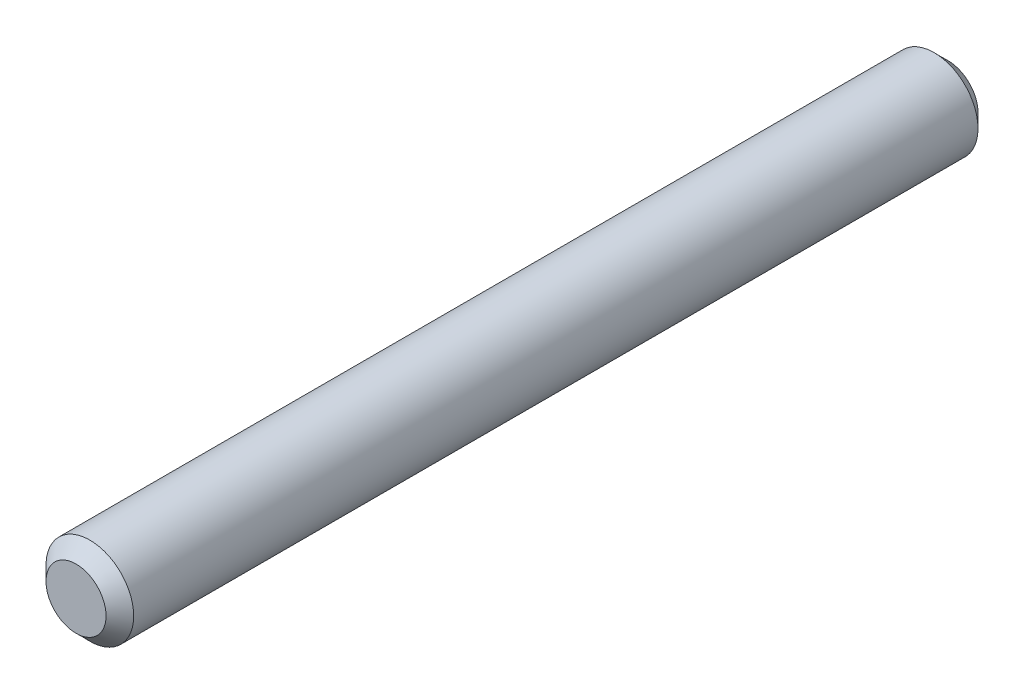
ISO-10303-21;
HEADER;
FILE_DESCRIPTION(('STEP AP214'),'2;1');
FILE_NAME('part.step','',(''),(''),'','','');
FILE_SCHEMA(('AUTOMOTIVE_DESIGN { 1 0 10303 214 1 1 1 1 }'));
ENDSEC;
DATA;
#1=APPLICATION_CONTEXT('core data for automotive mechanical design processes');
#2=APPLICATION_PROTOCOL_DEFINITION('international standard','automotive_design',2000,#1);
#3=PRODUCT_CONTEXT('',#1,'mechanical');
#4=PRODUCT('Part','Part','',(#3));
#5=PRODUCT_RELATED_PRODUCT_CATEGORY('part','',(#4));
#6=PRODUCT_DEFINITION_FORMATION('','',#4);
#7=PRODUCT_DEFINITION_CONTEXT('part definition',#1,'design');
#8=PRODUCT_DEFINITION('design','',#6,#7);
#9=PRODUCT_DEFINITION_SHAPE('','',#8);
#10=(LENGTH_UNIT() NAMED_UNIT(*) SI_UNIT(.MILLI.,.METRE.));
#11=(NAMED_UNIT(*) PLANE_ANGLE_UNIT() SI_UNIT($,.RADIAN.));
#12=(NAMED_UNIT(*) SI_UNIT($,.STERADIAN.) SOLID_ANGLE_UNIT());
#13=UNCERTAINTY_MEASURE_WITH_UNIT(LENGTH_MEASURE(1.E-05),#10,'distance_accuracy_value','');
#14=(GEOMETRIC_REPRESENTATION_CONTEXT(3) GLOBAL_UNCERTAINTY_ASSIGNED_CONTEXT((#13)) GLOBAL_UNIT_ASSIGNED_CONTEXT((#10,
#11,#12)) REPRESENTATION_CONTEXT('',''));
#15=CARTESIAN_POINT('',(0.,0.,0.));
#16=DIRECTION('',(0.,0.,1.));
#17=DIRECTION('',(1.,0.,0.));
#18=AXIS2_PLACEMENT_3D('',#15,#16,#17);
#19=CARTESIAN_POINT('',(0.,0.,-63.1419999539997));
#20=DIRECTION('',(0.,0.,0.999999999999998));
#21=DIRECTION('',(1.,0.,0.));
#22=AXIS2_PLACEMENT_3D('',#19,#20,#21);
#23=CYLINDRICAL_SURFACE('',#22,3.175);
#24=CARTESIAN_POINT('',(0.,0.,-62.1419999539998));
#25=DIRECTION('',(0.,0.,0.999999999999998));
#26=DIRECTION('',(1.,0.,0.));
#27=AXIS2_PLACEMENT_3D('',#24,#25,#26);
#28=CIRCLE('',#27,3.175);
#29=CARTESIAN_POINT('',(3.175,0.,-62.1419999539998));
#30=VERTEX_POINT('',#29);
#31=EDGE_CURVE('E59',#30,#30,#28,.T.);
#32=ORIENTED_EDGE('',*,*,#31,.T.);
#33=EDGE_LOOP('',(#32));
#34=FACE_BOUND('',#33,.T.);
#35=CARTESIAN_POINT('',(0.,0.,-1.));
#36=DIRECTION('',(0.,0.,0.999999999999998));
#37=DIRECTION('',(1.,0.,0.));
#38=AXIS2_PLACEMENT_3D('',#35,#36,#37);
#39=CIRCLE('',#38,3.175);
#40=CARTESIAN_POINT('',(3.175,0.,-1.));
#41=VERTEX_POINT('',#40);
#42=EDGE_CURVE('E63',#41,#41,#39,.F.);
#43=ORIENTED_EDGE('',*,*,#42,.T.);
#44=EDGE_LOOP('',(#43));
#45=FACE_BOUND('',#44,.T.);
#46=ADVANCED_FACE('F48',(#34,#45),#23,.T.);
#47=CARTESIAN_POINT('',(0.,0.,-63.1419999539997));
#48=DIRECTION('',(0.,0.,0.999999999999998));
#49=DIRECTION('',(1.,0.,0.));
#50=AXIS2_PLACEMENT_3D('',#47,#48,#49);
#51=PLANE('',#50);
#52=CARTESIAN_POINT('',(0.,0.,-63.1419999539997));
#53=DIRECTION('',(0.,0.,0.999999999999998));
#54=DIRECTION('',(1.,0.,0.));
#55=AXIS2_PLACEMENT_3D('',#52,#53,#54);
#56=CIRCLE('',#55,2.175);
#57=CARTESIAN_POINT('',(2.175,0.,-63.1419999539997));
#58=VERTEX_POINT('',#57);
#59=EDGE_CURVE('E55',#58,#58,#56,.F.);
#60=ORIENTED_EDGE('',*,*,#59,.T.);
#61=EDGE_LOOP('',(#60));
#62=FACE_BOUND('',#61,.T.);
#63=ADVANCED_FACE('F79',(#62),#51,.F.);
#64=CARTESIAN_POINT('',(0.,0.,0.));
#65=DIRECTION('',(0.,0.,0.999999999999998));
#66=DIRECTION('',(1.,0.,0.));
#67=AXIS2_PLACEMENT_3D('',#64,#65,#66);
#68=PLANE('',#67);
#69=CARTESIAN_POINT('',(0.,0.,0.));
#70=DIRECTION('',(0.,0.,0.999999999999998));
#71=DIRECTION('',(1.,0.,0.));
#72=AXIS2_PLACEMENT_3D('',#69,#70,#71);
#73=CIRCLE('',#72,2.175);
#74=CARTESIAN_POINT('',(2.175,0.,0.));
#75=VERTEX_POINT('',#74);
#76=EDGE_CURVE('E12',#75,#75,#73,.T.);
#77=ORIENTED_EDGE('',*,*,#76,.T.);
#78=EDGE_LOOP('',(#77));
#79=FACE_BOUND('',#78,.T.);
#80=ADVANCED_FACE('F76',(#79),#68,.T.);
#81=CARTESIAN_POINT('',(0.,0.,-62.1419999539998));
#82=DIRECTION('',(0.,0.,0.999999999999998));
#83=DIRECTION('',(1.,0.,0.));
#84=AXIS2_PLACEMENT_3D('',#81,#82,#83);
#85=CONICAL_SURFACE('',#84,3.175,0.785398163397446);
#86=ORIENTED_EDGE('',*,*,#59,.F.);
#87=EDGE_LOOP('',(#86));
#88=FACE_BOUND('',#87,.T.);
#89=ORIENTED_EDGE('',*,*,#31,.F.);
#90=EDGE_LOOP('',(#89));
#91=FACE_BOUND('',#90,.T.);
#92=ADVANCED_FACE('F72',(#88,#91),#85,.T.);
#93=CARTESIAN_POINT('',(0.,0.,0.));
#94=DIRECTION('',(0.,0.,-0.999999999999998));
#95=DIRECTION('',(-1.,0.,0.));
#96=AXIS2_PLACEMENT_3D('',#93,#94,#95);
#97=CONICAL_SURFACE('',#96,2.175,0.785398163397446);
#98=ORIENTED_EDGE('',*,*,#42,.F.);
#99=EDGE_LOOP('',(#98));
#100=FACE_BOUND('',#99,.T.);
#101=ORIENTED_EDGE('',*,*,#76,.F.);
#102=EDGE_LOOP('',(#101));
#103=FACE_BOUND('',#102,.T.);
#104=ADVANCED_FACE('F50',(#100,#103),#97,.T.);
#105=CLOSED_SHELL('',(#46,#63,#80,#92,#104));
#106=MANIFOLD_SOLID_BREP('B2',#105);
#107=ADVANCED_BREP_SHAPE_REPRESENTATION('',(#18,#106),#14);
#108=SHAPE_DEFINITION_REPRESENTATION(#9,#107);
ENDSEC;
END-ISO-10303-21;
